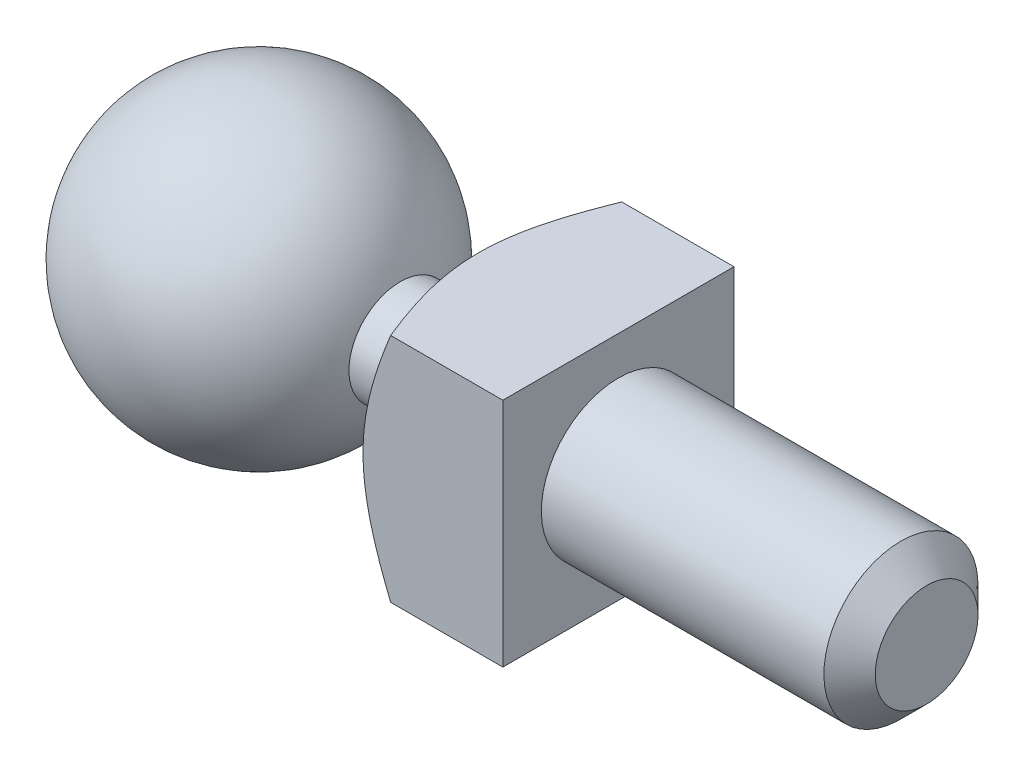
ISO-10303-21;
HEADER;
FILE_DESCRIPTION(('STEP AP214'),'2;1');
FILE_NAME('part.step','',(''),(''),'','','');
FILE_SCHEMA(('AUTOMOTIVE_DESIGN { 1 0 10303 214 1 1 1 1 }'));
ENDSEC;
DATA;
#1=APPLICATION_CONTEXT('core data for automotive mechanical design processes');
#2=APPLICATION_PROTOCOL_DEFINITION('international standard','automotive_design',2000,#1);
#3=PRODUCT_CONTEXT('',#1,'mechanical');
#4=PRODUCT('Part','Part','',(#3));
#5=PRODUCT_RELATED_PRODUCT_CATEGORY('part','',(#4));
#6=PRODUCT_DEFINITION_FORMATION('','',#4);
#7=PRODUCT_DEFINITION_CONTEXT('part definition',#1,'design');
#8=PRODUCT_DEFINITION('design','',#6,#7);
#9=PRODUCT_DEFINITION_SHAPE('','',#8);
#10=(LENGTH_UNIT() NAMED_UNIT(*) SI_UNIT(.MILLI.,.METRE.));
#11=(NAMED_UNIT(*) PLANE_ANGLE_UNIT() SI_UNIT($,.RADIAN.));
#12=(NAMED_UNIT(*) SI_UNIT($,.STERADIAN.) SOLID_ANGLE_UNIT());
#13=UNCERTAINTY_MEASURE_WITH_UNIT(LENGTH_MEASURE(1.E-05),#10,'distance_accuracy_value','');
#14=(GEOMETRIC_REPRESENTATION_CONTEXT(3) GLOBAL_UNCERTAINTY_ASSIGNED_CONTEXT((#13)) GLOBAL_UNIT_ASSIGNED_CONTEXT((#10,
#11,#12)) REPRESENTATION_CONTEXT('',''));
#15=CARTESIAN_POINT('',(0.,0.,0.));
#16=DIRECTION('',(0.,0.,1.));
#17=DIRECTION('',(1.,0.,0.));
#18=AXIS2_PLACEMENT_3D('',#15,#16,#17);
#19=CARTESIAN_POINT('',(0.,0.,0.));
#20=DIRECTION('',(1.,0.,0.));
#21=DIRECTION('',(0.,1.,0.));
#22=AXIS2_PLACEMENT_3D('',#19,#20,#21);
#23=SPHERICAL_SURFACE('',#22,2.93);
#24=CARTESIAN_POINT('',(2.75406971589319,0.,0.));
#25=DIRECTION('',(1.,0.,0.));
#26=DIRECTION('',(0.,1.,0.));
#27=AXIS2_PLACEMENT_3D('',#24,#25,#26);
#28=CIRCLE('',#27,0.999999999999999);
#29=CARTESIAN_POINT('',(2.75406971589319,0.999999999999999,0.));
#30=VERTEX_POINT('',#29);
#31=EDGE_CURVE('E95',#30,#30,#28,.T.);
#32=ORIENTED_EDGE('',*,*,#31,.F.);
#33=EDGE_LOOP('',(#32));
#34=FACE_BOUND('',#33,.T.);
#35=ADVANCED_FACE('F34',(#34),#23,.T.);
#36=CARTESIAN_POINT('',(13.,1.5,0.));
#37=DIRECTION('',(1.,0.,0.));
#38=DIRECTION('',(0.,1.,0.));
#39=AXIS2_PLACEMENT_3D('',#36,#37,#38);
#40=PLANE('',#39);
#41=CARTESIAN_POINT('',(13.,0.,0.));
#42=DIRECTION('',(1.,0.,0.));
#43=DIRECTION('',(0.,1.,0.));
#44=AXIS2_PLACEMENT_3D('',#41,#42,#43);
#45=CIRCLE('',#44,0.999999999999999);
#46=CARTESIAN_POINT('',(13.,0.999999999999999,0.));
#47=VERTEX_POINT('',#46);
#48=EDGE_CURVE('E42',#47,#47,#45,.T.);
#49=ORIENTED_EDGE('',*,*,#48,.T.);
#50=EDGE_LOOP('',(#49));
#51=FACE_BOUND('',#50,.T.);
#52=ADVANCED_FACE('F139',(#51),#40,.T.);
#53=CARTESIAN_POINT('',(13.,0.,0.));
#54=DIRECTION('',(1.,0.,0.));
#55=DIRECTION('',(0.,1.,0.));
#56=AXIS2_PLACEMENT_3D('',#53,#54,#55);
#57=CYLINDRICAL_SURFACE('',#56,1.5);
#58=CARTESIAN_POINT('',(12.5,0.,0.));
#59=DIRECTION('',(1.,0.,0.));
#60=DIRECTION('',(0.,1.,0.));
#61=AXIS2_PLACEMENT_3D('',#58,#59,#60);
#62=CIRCLE('',#61,1.5);
#63=CARTESIAN_POINT('',(12.5,1.5,0.));
#64=VERTEX_POINT('',#63);
#65=EDGE_CURVE('E11',#64,#64,#62,.F.);
#66=ORIENTED_EDGE('',*,*,#65,.T.);
#67=EDGE_LOOP('',(#66));
#68=FACE_BOUND('',#67,.T.);
#69=CARTESIAN_POINT('',(7.,0.,0.));
#70=DIRECTION('',(1.,0.,0.));
#71=DIRECTION('',(0.,1.,0.));
#72=AXIS2_PLACEMENT_3D('',#69,#70,#71);
#73=CIRCLE('',#72,1.5);
#74=CARTESIAN_POINT('',(7.,1.5,0.));
#75=VERTEX_POINT('',#74);
#76=EDGE_CURVE('E105',#75,#75,#73,.T.);
#77=ORIENTED_EDGE('',*,*,#76,.T.);
#78=EDGE_LOOP('',(#77));
#79=FACE_BOUND('',#78,.T.);
#80=ADVANCED_FACE('F144',(#68,#79),#57,.T.);
#81=CARTESIAN_POINT('',(7.,3.5,0.));
#82=DIRECTION('',(1.,0.,0.));
#83=DIRECTION('',(0.,1.,0.));
#84=AXIS2_PLACEMENT_3D('',#81,#82,#83);
#85=PLANE('',#84);
#86=DIRECTION('',(0.,-1.,0.));
#87=VECTOR('',#86,1.);
#88=CARTESIAN_POINT('',(7.,2.25,-2.25));
#89=LINE('',#88,#87);
#90=CARTESIAN_POINT('',(7.,2.25,-2.25));
#91=VERTEX_POINT('',#90);
#92=CARTESIAN_POINT('',(7.,-2.25,-2.25));
#93=VERTEX_POINT('',#92);
#94=EDGE_CURVE('E49',#91,#93,#89,.T.);
#95=ORIENTED_EDGE('',*,*,#94,.F.);
#96=DIRECTION('',(0.,0.,-1.));
#97=VECTOR('',#96,1.);
#98=CARTESIAN_POINT('',(7.,2.25,2.6809513236909));
#99=LINE('',#98,#97);
#100=CARTESIAN_POINT('',(7.,2.25,2.25));
#101=VERTEX_POINT('',#100);
#102=EDGE_CURVE('E89',#101,#91,#99,.T.);
#103=ORIENTED_EDGE('',*,*,#102,.F.);
#104=DIRECTION('',(0.,1.,0.));
#105=VECTOR('',#104,1.);
#106=CARTESIAN_POINT('',(7.,2.25,2.25));
#107=LINE('',#106,#105);
#108=CARTESIAN_POINT('',(7.,-2.25,2.25));
#109=VERTEX_POINT('',#108);
#110=EDGE_CURVE('E226',#109,#101,#107,.T.);
#111=ORIENTED_EDGE('',*,*,#110,.F.);
#112=DIRECTION('',(0.,0.,1.));
#113=VECTOR('',#112,1.);
#114=CARTESIAN_POINT('',(7.,-2.25,2.6809513236909));
#115=LINE('',#114,#113);
#116=EDGE_CURVE('E90',#93,#109,#115,.T.);
#117=ORIENTED_EDGE('',*,*,#116,.F.);
#118=EDGE_LOOP('',(#95,#103,#111,#117));
#119=FACE_BOUND('',#118,.T.);
#120=ORIENTED_EDGE('',*,*,#76,.F.);
#121=EDGE_LOOP('',(#120));
#122=FACE_BOUND('',#121,.T.);
#123=ADVANCED_FACE('F86',(#119,#122),#85,.T.);
#124=CARTESIAN_POINT('',(5.,0.,0.));
#125=DIRECTION('',(1.,0.,0.));
#126=DIRECTION('',(0.,1.,0.));
#127=AXIS2_PLACEMENT_3D('',#124,#125,#126);
#128=CONICAL_SURFACE('',#127,3.5,1.04719755119659);
#129=CARTESIAN_POINT('',(5.86034383960185,-4.45412048133046,-2.25));
#130=CARTESIAN_POINT('',(5.80409796865008,-4.34495840750382,-2.25));
#131=CARTESIAN_POINT('',(5.74817027483859,-4.23563076856428,-2.25));
#132=CARTESIAN_POINT('',(5.63712120538929,-4.01655867667886,-2.25));
#133=CARTESIAN_POINT('',(5.58199987885308,-3.906814198859,-2.25));
#134=CARTESIAN_POINT('',(5.47261288973695,-3.68657929952362,-2.25));
#135=CARTESIAN_POINT('',(5.41834952406275,-3.57608773491769,-2.25));
#136=CARTESIAN_POINT('',(5.31105407722902,-3.35451008879523,-2.25));
#137=CARTESIAN_POINT('',(5.2580219710597,-3.24342401941098,-2.25));
#138=CARTESIAN_POINT('',(5.15059383123246,-3.01431685986266,-2.25));
#139=CARTESIAN_POINT('',(5.09628634237491,-2.89625411328464,-2.25));
#140=CARTESIAN_POINT('',(4.98990333398757,-2.65912837226199,-2.25));
#141=CARTESIAN_POINT('',(4.93782773380177,-2.5400654141493,-2.25));
#142=CARTESIAN_POINT('',(4.83664749236006,-2.3007918583816,-2.25));
#143=CARTESIAN_POINT('',(4.78754042416504,-2.18058229385271,-2.25));
#144=CARTESIAN_POINT('',(4.69322647174154,-1.93865008704879,-2.25));
#145=CARTESIAN_POINT('',(4.64801908324752,-1.81692764273935,-2.25));
#146=CARTESIAN_POINT('',(4.56330589825001,-1.57300940057008,-2.25));
#147=CARTESIAN_POINT('',(4.52374189032616,-1.45083418979248,-2.25));
#148=CARTESIAN_POINT('',(4.46953383362664,-1.26606680452056,-2.25));
#149=CARTESIAN_POINT('',(4.45232103779299,-1.20422789992981,-2.25));
#150=CARTESIAN_POINT('',(4.41985945750954,-1.08001397293359,-2.25));
#151=CARTESIAN_POINT('',(4.40461137330032,-1.01763876778854,-2.25));
#152=CARTESIAN_POINT('',(4.36278027165919,-0.832189634968537,-2.25));
#153=CARTESIAN_POINT('',(4.33938036230688,-0.708369462746123,-2.25));
#154=CARTESIAN_POINT('',(4.30326654869105,-0.459174579321724,-2.25));
#155=CARTESIAN_POINT('',(4.29054816450314,-0.333800542235146,-2.25));
#156=CARTESIAN_POINT('',(4.27980792429339,-0.132050664820355,-2.25));
#157=CARTESIAN_POINT('',(4.27796683756936,-0.0558657713500594,-2.25));
#158=CARTESIAN_POINT('',(4.27876329379624,0.0964781067003903,-2.25));
#159=CARTESIAN_POINT('',(4.28140044935276,0.172637092951649,-2.25));
#160=CARTESIAN_POINT('',(4.29104245575081,0.324693699795921,-2.25));
#161=CARTESIAN_POINT('',(4.29804847530763,0.400591244986225,-2.25));
#162=CARTESIAN_POINT('',(4.31613734661439,0.551897537565175,-2.25));
#163=CARTESIAN_POINT('',(4.32722043926637,0.627306255802519,-2.25));
#164=CARTESIAN_POINT('',(4.35341290101767,0.779551222005937,-2.25));
#165=CARTESIAN_POINT('',(4.36862463512182,0.856369680093358,-2.25));
#166=CARTESIAN_POINT('',(4.40242819238122,1.00925307448264,-2.25));
#167=CARTESIAN_POINT('',(4.42102007469835,1.085317997571,-2.25));
#168=CARTESIAN_POINT('',(4.46109976802804,1.23671019624537,-2.25));
#169=CARTESIAN_POINT('',(4.48258881962152,1.31203714092174,-2.25));
#170=CARTESIAN_POINT('',(4.52800561382837,1.46194198292063,-2.25));
#171=CARTESIAN_POINT('',(4.55193321972537,1.53651992197855,-2.25));
#172=CARTESIAN_POINT('',(4.62332958263679,1.74897906332623,-2.25));
#173=CARTESIAN_POINT('',(4.67331206401782,1.88601489043221,-2.25));
#174=CARTESIAN_POINT('',(4.77833582949507,2.15814610617328,-2.25));
#175=CARTESIAN_POINT('',(4.83337858049892,2.29324091892659,-2.25));
#176=CARTESIAN_POINT('',(4.9471832077542,2.56200011880604,-2.25));
#177=CARTESIAN_POINT('',(5.00594862854344,2.69566299656587,-2.25));
#178=CARTESIAN_POINT('',(5.12617768507156,2.96174497223753,-2.25));
#179=CARTESIAN_POINT('',(5.18764102615396,3.09416420406739,-2.25));
#180=CARTESIAN_POINT('',(5.31280819059338,3.35847842415153,-2.25));
#181=CARTESIAN_POINT('',(5.37651881573421,3.49037018095607,-2.25));
#182=CARTESIAN_POINT('',(5.50551004492557,3.75338491830392,-2.25));
#183=CARTESIAN_POINT('',(5.57079068134851,3.88450788292586,-2.25));
#184=CARTESIAN_POINT('',(5.76837107296348,4.27681681420728,-2.25));
#185=CARTESIAN_POINT('',(5.90248031635392,4.53709053334557,-2.25));
#186=CARTESIAN_POINT('',(6.15547959892446,5.02108573113561,-2.25));
#187=CARTESIAN_POINT('',(6.27398663745045,5.24500878852145,-2.25));
#188=CARTESIAN_POINT('',(6.51265366330582,5.69201679746049,-2.25));
#189=CARTESIAN_POINT('',(6.63281390524972,5.91510161302288,-2.25));
#190=CARTESIAN_POINT('',(6.87350062557749,6.35911256479582,-2.25));
#191=CARTESIAN_POINT('',(6.99401906454412,6.58004306773227,-2.25));
#192=CARTESIAN_POINT('',(7.23593493244803,7.02137104308705,-2.25));
#193=CARTESIAN_POINT('',(7.3573321999493,7.2417686039548,-2.25));
#194=CARTESIAN_POINT('',(7.47904462885251,7.46199072468933,-2.25));
#195=B_SPLINE_CURVE_WITH_KNOTS('',3,(#129,#130,#131,#132,#133,#134,#135,#136,#137,#138,#139,
#140,#141,#142,#143,#144,#145,#146,#147,#148,#149,#150,#151,#152,#153,#154,#155,#156,#157,#158,
#159,#160,#161,#162,#163,#164,#165,#166,#167,#168,#169,#170,#171,#172,#173,#174,#175,#176,#177,
#178,#179,#180,#181,#182,#183,#184,#185,#186,#187,#188,#189,#190,#191,#192,#193,#194),
.UNSPECIFIED.,.F.,.F.,(4,2,2,2,2,2,2,2,2,2,2,2,2,2,2,2,2,2,2,2,2,2,2,2,2,2,2,2,2,2,2,2,4),(0.,
0.368403050374347,0.73682844107798,1.10611357428642,1.47539119986834,1.86523628739655,
2.25506727480336,2.64457511899298,3.03403252038826,3.41912597175193,3.61166663532637,
3.80427573338545,4.18191842056213,4.55940264190891,4.78790325879115,5.01638411002808,
5.24492610843865,5.47348161288175,5.7083239985989,5.9431704950985,6.17811787522828,
6.41305209038466,6.85049275236988,7.28806062510517,7.72605157917063,8.16399481599487,
8.60340179648496,9.04281784498672,9.92115834686142,10.6811974198966,11.4413548890038,
12.1963460239652,12.9512018228935),.UNSPECIFIED.);
#196=CARTESIAN_POINT('',(4.81639136492369,-2.25,-2.25));
#197=VERTEX_POINT('',#196);
#198=CARTESIAN_POINT('',(4.81639136492369,2.25,-2.25));
#199=VERTEX_POINT('',#198);
#200=EDGE_CURVE('E78',#197,#199,#195,.T.);
#201=ORIENTED_EDGE('',*,*,#200,.F.);
#202=CARTESIAN_POINT('',(6.28876082837321,-2.25,-5.27215402402813));
#203=CARTESIAN_POINT('',(6.22450474204957,-2.25,-5.15113453155913));
#204=CARTESIAN_POINT('',(6.16050373501307,-2.25,-5.02997867433084));
#205=CARTESIAN_POINT('',(6.03314503107468,-2.25,-4.78732443626679));
#206=CARTESIAN_POINT('',(5.96978735514456,-2.25,-4.66582604442874));
#207=CARTESIAN_POINT('',(5.84377624425233,-2.25,-4.42227710922074));
#208=CARTESIAN_POINT('',(5.78112375723229,-2.25,-4.30022607471742));
#209=CARTESIAN_POINT('',(5.65679032468332,-2.25,-4.05563140229241));
#210=CARTESIAN_POINT('',(5.59510936748794,-2.25,-3.93308777030822));
#211=CARTESIAN_POINT('',(5.46906463583891,-2.25,-3.67955064949904));
#212=CARTESIAN_POINT('',(5.40478101934955,-2.25,-3.54851721698607));
#213=CARTESIAN_POINT('',(5.27799678328084,-2.25,-3.28559124026794));
#214=CARTESIAN_POINT('',(5.21549613038265,-2.25,-3.15369871217364));
#215=CARTESIAN_POINT('',(5.09286818644937,-2.25,-2.88887548639274));
#216=CARTESIAN_POINT('',(5.03273993051372,-2.25,-2.75594523767649));
#217=CARTESIAN_POINT('',(4.91564401516198,-2.25,-2.48870630956857));
#218=CARTESIAN_POINT('',(4.85867610119135,-2.25,-2.35439774223132));
#219=CARTESIAN_POINT('',(4.74166814672203,-2.25,-2.06580740134562));
#220=CARTESIAN_POINT('',(4.68224714117716,-2.25,-1.91127111314026));
#221=CARTESIAN_POINT('',(4.57143700822848,-2.25,-1.59925085059149));
#222=CARTESIAN_POINT('',(4.52005013258039,-2.25,-1.44176606366037));
#223=CARTESIAN_POINT('',(4.43009705607375,-2.25,-1.12708767695283));
#224=CARTESIAN_POINT('',(4.39125486157125,-2.25,-0.969976331192509));
#225=CARTESIAN_POINT('',(4.34466441846132,-2.25,-0.732069679473725));
#226=CARTESIAN_POINT('',(4.33108177221732,-2.25,-0.652415306514375));
#227=CARTESIAN_POINT('',(4.30831193543774,-2.25,-0.492486113587141));
#228=CARTESIAN_POINT('',(4.29912430983061,-2.25,-0.412211355832105));
#229=CARTESIAN_POINT('',(4.280990941474,-2.25,-0.196620580672468));
#230=CARTESIAN_POINT('',(4.27643540584421,-2.25,-0.0608995022600645));
#231=CARTESIAN_POINT('',(4.28161896226905,-2.25,0.210225534625882));
#232=CARTESIAN_POINT('',(4.29135680155205,-2.25,0.345629519849896));
#233=CARTESIAN_POINT('',(4.32416809557623,-2.25,0.618003678315841));
#234=CARTESIAN_POINT('',(4.34755031755061,-2.25,0.754935597246552));
#235=CARTESIAN_POINT('',(4.39081063922233,-2.25,0.958545863431208));
#236=CARTESIAN_POINT('',(4.40660181742953,-2.25,1.02614005815985));
#237=CARTESIAN_POINT('',(4.44056642491053,-2.25,1.16072498339881));
#238=CARTESIAN_POINT('',(4.45873970517105,-2.25,1.22771575137681));
#239=CARTESIAN_POINT('',(4.51227524625755,-2.25,1.41367878982504));
#240=CARTESIAN_POINT('',(4.54989467283036,-2.25,1.53200017389067));
#241=CARTESIAN_POINT('',(4.63009916293539,-2.25,1.76695990204816));
#242=CARTESIAN_POINT('',(4.6726857819968,-2.25,1.88359770598938));
#243=CARTESIAN_POINT('',(4.76164511478409,-2.25,2.11555193189705));
#244=CARTESIAN_POINT('',(4.80802178680806,-2.25,2.23086682516245));
#245=CARTESIAN_POINT('',(4.90362228211462,-2.25,2.46031508375231));
#246=CARTESIAN_POINT('',(4.95284637042485,-2.25,2.57444833792451));
#247=CARTESIAN_POINT('',(5.05368971229989,-2.25,2.80222533988991));
#248=CARTESIAN_POINT('',(5.10531821351763,-2.25,2.91586497720077));
#249=CARTESIAN_POINT('',(5.21029195408943,-2.25,3.14235003815041));
#250=CARTESIAN_POINT('',(5.26363724814803,-2.25,3.25519543634135));
#251=CARTESIAN_POINT('',(5.42569096043756,-2.25,3.5927871389017));
#252=CARTESIAN_POINT('',(5.53640812021851,-2.25,3.81656880263123));
#253=CARTESIAN_POINT('',(5.69915353805128,-2.25,4.13920611884436));
#254=CARTESIAN_POINT('',(5.74980586128649,-2.25,4.23876409117146));
#255=CARTESIAN_POINT('',(5.85169717831487,-2.25,4.43757274064262));
#256=CARTESIAN_POINT('',(5.90293613764671,-2.25,4.53682343540666));
#257=CARTESIAN_POINT('',(6.05741162087119,-2.25,4.83423222342052));
#258=CARTESIAN_POINT('',(6.16138629449011,-2.25,5.03200666350579));
#259=CARTESIAN_POINT('',(6.36973551405003,-2.25,5.42486548920937));
#260=CARTESIAN_POINT('',(6.47409618091824,-2.25,5.6199572554507));
#261=CARTESIAN_POINT('',(6.6838675780985,-2.25,6.00952067282206));
#262=CARTESIAN_POINT('',(6.78927807332976,-2.25,6.20399245045497));
#263=CARTESIAN_POINT('',(6.89506300869482,-2.25,6.39825830386648));
#264=B_SPLINE_CURVE_WITH_KNOTS('',3,(#202,#203,#204,#205,#206,#207,#208,#209,#210,#211,#212,
#213,#214,#215,#216,#217,#218,#219,#220,#221,#222,#223,#224,#225,#226,#227,#228,#229,#230,#231,
#232,#233,#234,#235,#236,#237,#238,#239,#240,#241,#242,#243,#244,#245,#246,#247,#248,#249,#250,
#251,#252,#253,#254,#255,#256,#257,#258,#259,#260,#261,#262,#263),.UNSPECIFIED.,.F.,.F.,(4,2,2,
2,2,2,2,2,2,2,2,2,2,2,2,2,2,2,2,2,2,2,2,2,2,2,2,2,2,2,4),(0.,0.411061812363979,
0.822136982069995,1.23371101365729,1.6452800991565,2.08312735823082,2.52096642973616,
2.95862554815609,3.39624936332024,3.8927932699587,4.38947609630069,4.87433934752985,
5.11664431483083,5.35892529093082,5.76552629074053,6.17209165531461,6.58823523734191,
6.79644468337781,7.00464111100458,7.37695377553779,7.74938334838089,8.12220697991334,
8.49506536858903,8.86950035764448,9.24394728967425,9.99290744492505,10.3280147845321,
10.6631025385927,11.3334137741989,11.9971629479937,12.6607666930849),.UNSPECIFIED.);
#265=CARTESIAN_POINT('',(4.81639136492369,-2.25,2.25));
#266=VERTEX_POINT('',#265);
#267=EDGE_CURVE('E115',#266,#197,#264,.F.);
#268=ORIENTED_EDGE('',*,*,#267,.F.);
#269=CARTESIAN_POINT('',(5.86034383960185,-4.45412048133046,2.25));
#270=CARTESIAN_POINT('',(5.80409796865008,-4.34495840750382,2.25));
#271=CARTESIAN_POINT('',(5.74817027483859,-4.23563076856428,2.25));
#272=CARTESIAN_POINT('',(5.63712120538929,-4.01655867667887,2.25));
#273=CARTESIAN_POINT('',(5.58199987885308,-3.906814198859,2.25));
#274=CARTESIAN_POINT('',(5.47261288973694,-3.68657929952362,2.25));
#275=CARTESIAN_POINT('',(5.41834952406275,-3.57608773491769,2.25));
#276=CARTESIAN_POINT('',(5.31105407722902,-3.35451008879523,2.25));
#277=CARTESIAN_POINT('',(5.2580219710597,-3.24342401941098,2.25));
#278=CARTESIAN_POINT('',(5.15059383123246,-3.01431685986266,2.25));
#279=CARTESIAN_POINT('',(5.09628634237491,-2.89625411328464,2.25));
#280=CARTESIAN_POINT('',(4.98990333398756,-2.65912837226199,2.25));
#281=CARTESIAN_POINT('',(4.93782773380177,-2.5400654141493,2.25));
#282=CARTESIAN_POINT('',(4.83664749236006,-2.3007918583816,2.25));
#283=CARTESIAN_POINT('',(4.78754042416504,-2.18058229385271,2.25));
#284=CARTESIAN_POINT('',(4.69322647174154,-1.93865008704879,2.25));
#285=CARTESIAN_POINT('',(4.64801908324752,-1.81692764273935,2.25));
#286=CARTESIAN_POINT('',(4.56330589825,-1.57300940057008,2.25));
#287=CARTESIAN_POINT('',(4.52374189032616,-1.45083418979248,2.25));
#288=CARTESIAN_POINT('',(4.46953383362665,-1.26606680452056,2.25));
#289=CARTESIAN_POINT('',(4.45232103779299,-1.20422789992981,2.25));
#290=CARTESIAN_POINT('',(4.41985945750954,-1.08001397293359,2.25));
#291=CARTESIAN_POINT('',(4.40461137330032,-1.01763876778854,2.25));
#292=CARTESIAN_POINT('',(4.36278027165919,-0.832189634968537,2.25));
#293=CARTESIAN_POINT('',(4.33938036230688,-0.708369462746124,2.25));
#294=CARTESIAN_POINT('',(4.30326654869105,-0.459174579321724,2.25));
#295=CARTESIAN_POINT('',(4.29054816450314,-0.333800542235147,2.25));
#296=CARTESIAN_POINT('',(4.27980792429339,-0.132050664820355,2.25));
#297=CARTESIAN_POINT('',(4.27796683756936,-0.0558657713500601,2.25));
#298=CARTESIAN_POINT('',(4.27876329379624,0.0964781067003896,2.25));
#299=CARTESIAN_POINT('',(4.28140044935276,0.172637092951648,2.25));
#300=CARTESIAN_POINT('',(4.29104245575081,0.32469369979592,2.25));
#301=CARTESIAN_POINT('',(4.29804847530763,0.400591244986224,2.25));
#302=CARTESIAN_POINT('',(4.31613734661439,0.551897537565174,2.25));
#303=CARTESIAN_POINT('',(4.32722043926637,0.627306255802518,2.25));
#304=CARTESIAN_POINT('',(4.35341290101767,0.779551222005937,2.25));
#305=CARTESIAN_POINT('',(4.36862463512182,0.856369680093357,2.25));
#306=CARTESIAN_POINT('',(4.40242819238122,1.00925307448264,2.25));
#307=CARTESIAN_POINT('',(4.42102007469835,1.085317997571,2.25));
#308=CARTESIAN_POINT('',(4.46109976802804,1.23671019624537,2.25));
#309=CARTESIAN_POINT('',(4.48258881962152,1.31203714092174,2.25));
#310=CARTESIAN_POINT('',(4.52800561382837,1.46194198292063,2.25));
#311=CARTESIAN_POINT('',(4.55193321972537,1.53651992197855,2.25));
#312=CARTESIAN_POINT('',(4.62332958263679,1.74897906332623,2.25));
#313=CARTESIAN_POINT('',(4.67331206401782,1.88601489043221,2.25));
#314=CARTESIAN_POINT('',(4.77833582949507,2.15814610617328,2.25));
#315=CARTESIAN_POINT('',(4.83337858049892,2.29324091892659,2.25));
#316=CARTESIAN_POINT('',(4.9471832077542,2.56200011880604,2.25));
#317=CARTESIAN_POINT('',(5.00594862854344,2.69566299656587,2.25));
#318=CARTESIAN_POINT('',(5.12617768507156,2.96174497223753,2.25));
#319=CARTESIAN_POINT('',(5.18764102615396,3.09416420406739,2.25));
#320=CARTESIAN_POINT('',(5.31280819059338,3.35847842415153,2.25));
#321=CARTESIAN_POINT('',(5.37651881573421,3.49037018095607,2.25));
#322=CARTESIAN_POINT('',(5.50551004492557,3.75338491830391,2.25));
#323=CARTESIAN_POINT('',(5.5707906813485,3.88450788292586,2.25));
#324=CARTESIAN_POINT('',(5.76837107296348,4.27681681420727,2.25));
#325=CARTESIAN_POINT('',(5.90248031635391,4.53709053334557,2.25));
#326=CARTESIAN_POINT('',(6.15547959892445,5.0210857311356,2.25));
#327=CARTESIAN_POINT('',(6.27398663745044,5.24500878852145,2.25));
#328=CARTESIAN_POINT('',(6.51265366330581,5.69201679746048,2.25));
#329=CARTESIAN_POINT('',(6.63281390524972,5.91510161302287,2.25));
#330=CARTESIAN_POINT('',(6.87350062557748,6.35911256479581,2.25));
#331=CARTESIAN_POINT('',(6.99401906454411,6.58004306773227,2.25));
#332=CARTESIAN_POINT('',(7.23593493244803,7.02137104308704,2.25));
#333=CARTESIAN_POINT('',(7.3573321999493,7.24176860395479,2.25));
#334=CARTESIAN_POINT('',(7.47904462885251,7.46199072468933,2.25));
#335=B_SPLINE_CURVE_WITH_KNOTS('',3,(#269,#270,#271,#272,#273,#274,#275,#276,#277,#278,#279,
#280,#281,#282,#283,#284,#285,#286,#287,#288,#289,#290,#291,#292,#293,#294,#295,#296,#297,#298,
#299,#300,#301,#302,#303,#304,#305,#306,#307,#308,#309,#310,#311,#312,#313,#314,#315,#316,#317,
#318,#319,#320,#321,#322,#323,#324,#325,#326,#327,#328,#329,#330,#331,#332,#333,#334),
.UNSPECIFIED.,.F.,.F.,(4,2,2,2,2,2,2,2,2,2,2,2,2,2,2,2,2,2,2,2,2,2,2,2,2,2,2,2,2,2,2,2,4),(0.,
0.368403050374346,0.736828441077979,1.10611357428642,1.47539119986834,1.86523628739655,
2.25506727480336,2.64457511899298,3.03403252038826,3.41912597175193,3.61166663532637,
3.80427573338545,4.18191842056213,4.55940264190891,4.78790325879115,5.01638411002808,
5.24492610843865,5.47348161288175,5.7083239985989,5.9431704950985,6.17811787522828,
6.41305209038466,6.85049275236988,7.28806062510517,7.72605157917063,8.16399481599487,
8.60340179648496,9.04281784498672,9.92115834686142,10.6811974198966,11.4413548890038,
12.1963460239652,12.9512018228935),.UNSPECIFIED.);
#336=CARTESIAN_POINT('',(4.81639136492369,2.25,2.25));
#337=VERTEX_POINT('',#336);
#338=EDGE_CURVE('E57',#337,#266,#335,.F.);
#339=ORIENTED_EDGE('',*,*,#338,.F.);
#340=CARTESIAN_POINT('',(6.28876082837321,2.25,-5.27215402402813));
#341=CARTESIAN_POINT('',(6.22450474204957,2.25,-5.15113453155913));
#342=CARTESIAN_POINT('',(6.16050373501307,2.25,-5.02997867433084));
#343=CARTESIAN_POINT('',(6.03314503107468,2.25,-4.78732443626679));
#344=CARTESIAN_POINT('',(5.96978735514456,2.25,-4.66582604442874));
#345=CARTESIAN_POINT('',(5.84377624425233,2.25,-4.42227710922075));
#346=CARTESIAN_POINT('',(5.78112375723229,2.25,-4.30022607471742));
#347=CARTESIAN_POINT('',(5.65679032468332,2.25,-4.05563140229241));
#348=CARTESIAN_POINT('',(5.59510936748794,2.25,-3.93308777030822));
#349=CARTESIAN_POINT('',(5.46906463583891,2.25,-3.67955064949904));
#350=CARTESIAN_POINT('',(5.40478101934955,2.25,-3.54851721698607));
#351=CARTESIAN_POINT('',(5.27799678328084,2.25,-3.28559124026794));
#352=CARTESIAN_POINT('',(5.21549613038265,2.25,-3.15369871217364));
#353=CARTESIAN_POINT('',(5.09286818644937,2.25,-2.88887548639275));
#354=CARTESIAN_POINT('',(5.03273993051372,2.25,-2.75594523767649));
#355=CARTESIAN_POINT('',(4.91564401516198,2.25,-2.48870630956857));
#356=CARTESIAN_POINT('',(4.85867610119135,2.25,-2.35439774223132));
#357=CARTESIAN_POINT('',(4.74166814672204,2.25,-2.06580740134562));
#358=CARTESIAN_POINT('',(4.68224714117717,2.25,-1.91127111314026));
#359=CARTESIAN_POINT('',(4.57143700822848,2.25,-1.59925085059149));
#360=CARTESIAN_POINT('',(4.52005013258039,2.25,-1.44176606366037));
#361=CARTESIAN_POINT('',(4.43009705607375,2.25,-1.12708767695283));
#362=CARTESIAN_POINT('',(4.39125486157125,2.25,-0.969976331192509));
#363=CARTESIAN_POINT('',(4.34466441846132,2.25,-0.732069679473725));
#364=CARTESIAN_POINT('',(4.33108177221732,2.25,-0.652415306514375));
#365=CARTESIAN_POINT('',(4.30831193543774,2.25,-0.492486113587141));
#366=CARTESIAN_POINT('',(4.29912430983061,2.25,-0.412211355832105));
#367=CARTESIAN_POINT('',(4.280990941474,2.25,-0.196620580672468));
#368=CARTESIAN_POINT('',(4.27643540584421,2.25,-0.0608995022600646));
#369=CARTESIAN_POINT('',(4.28161896226905,2.25,0.210225534625881));
#370=CARTESIAN_POINT('',(4.29135680155205,2.25,0.345629519849895));
#371=CARTESIAN_POINT('',(4.32416809557623,2.25,0.61800367831584));
#372=CARTESIAN_POINT('',(4.34755031755061,2.25,0.754935597246551));
#373=CARTESIAN_POINT('',(4.39081063922233,2.25,0.958545863431207));
#374=CARTESIAN_POINT('',(4.40660181742953,2.25,1.02614005815985));
#375=CARTESIAN_POINT('',(4.44056642491053,2.25,1.16072498339881));
#376=CARTESIAN_POINT('',(4.45873970517105,2.25,1.22771575137681));
#377=CARTESIAN_POINT('',(4.51227524625755,2.25,1.41367878982504));
#378=CARTESIAN_POINT('',(4.54989467283036,2.25,1.53200017389067));
#379=CARTESIAN_POINT('',(4.63009916293539,2.25,1.76695990204816));
#380=CARTESIAN_POINT('',(4.6726857819968,2.25,1.88359770598938));
#381=CARTESIAN_POINT('',(4.76164511478409,2.25,2.11555193189705));
#382=CARTESIAN_POINT('',(4.80802178680806,2.25,2.23086682516245));
#383=CARTESIAN_POINT('',(4.90362228211462,2.25,2.46031508375231));
#384=CARTESIAN_POINT('',(4.95284637042485,2.25,2.57444833792451));
#385=CARTESIAN_POINT('',(5.05368971229989,2.25,2.80222533988991));
#386=CARTESIAN_POINT('',(5.10531821351763,2.25,2.91586497720077));
#387=CARTESIAN_POINT('',(5.21029195408943,2.25,3.14235003815041));
#388=CARTESIAN_POINT('',(5.26363724814803,2.25,3.25519543634135));
#389=CARTESIAN_POINT('',(5.42569096043756,2.25,3.59278713890171));
#390=CARTESIAN_POINT('',(5.53640812021851,2.25,3.81656880263123));
#391=CARTESIAN_POINT('',(5.69915353805128,2.25,4.13920611884436));
#392=CARTESIAN_POINT('',(5.74980586128649,2.25,4.23876409117145));
#393=CARTESIAN_POINT('',(5.85169717831487,2.25,4.43757274064262));
#394=CARTESIAN_POINT('',(5.90293613764672,2.25,4.53682343540666));
#395=CARTESIAN_POINT('',(6.05741162087119,2.25,4.83423222342052));
#396=CARTESIAN_POINT('',(6.16138629449011,2.25,5.03200666350579));
#397=CARTESIAN_POINT('',(6.36973551405003,2.25,5.42486548920937));
#398=CARTESIAN_POINT('',(6.47409618091824,2.25,5.6199572554507));
#399=CARTESIAN_POINT('',(6.6838675780985,2.25,6.00952067282206));
#400=CARTESIAN_POINT('',(6.78927807332976,2.25,6.20399245045497));
#401=CARTESIAN_POINT('',(6.89506300869482,2.25,6.39825830386648));
#402=B_SPLINE_CURVE_WITH_KNOTS('',3,(#340,#341,#342,#343,#344,#345,#346,#347,#348,#349,#350,
#351,#352,#353,#354,#355,#356,#357,#358,#359,#360,#361,#362,#363,#364,#365,#366,#367,#368,#369,
#370,#371,#372,#373,#374,#375,#376,#377,#378,#379,#380,#381,#382,#383,#384,#385,#386,#387,#388,
#389,#390,#391,#392,#393,#394,#395,#396,#397,#398,#399,#400,#401),.UNSPECIFIED.,.F.,.F.,(4,2,2,
2,2,2,2,2,2,2,2,2,2,2,2,2,2,2,2,2,2,2,2,2,2,2,2,2,2,2,4),(0.,0.411061812363977,
0.822136982069994,1.23371101365729,1.6452800991565,2.08312735823082,2.52096642973616,
2.95862554815609,3.39624936332024,3.8927932699587,4.38947609630069,4.87433934752985,
5.11664431483083,5.35892529093082,5.76552629074053,6.17209165531461,6.58823523734191,
6.79644468337781,7.00464111100458,7.37695377553779,7.7493833483809,8.12220697991334,
8.49506536858903,8.86950035764448,9.24394728967425,9.99290744492505,10.328014784532,
10.6631025385927,11.3334137741989,11.9971629479937,12.6607666930849),.UNSPECIFIED.);
#403=EDGE_CURVE('E108',#199,#337,#402,.T.);
#404=ORIENTED_EDGE('',*,*,#403,.F.);
#405=EDGE_LOOP('',(#201,#268,#339,#404));
#406=FACE_BOUND('',#405,.T.);
#407=CARTESIAN_POINT('',(3.55662432702592,0.,0.));
#408=DIRECTION('',(1.,0.,0.));
#409=DIRECTION('',(0.,1.,0.));
#410=AXIS2_PLACEMENT_3D('',#407,#408,#409);
#411=CIRCLE('',#410,0.999999999999999);
#412=CARTESIAN_POINT('',(3.55662432702592,0.999999999999999,0.));
#413=VERTEX_POINT('',#412);
#414=EDGE_CURVE('E98',#413,#413,#411,.T.);
#415=ORIENTED_EDGE('',*,*,#414,.T.);
#416=EDGE_LOOP('',(#415));
#417=FACE_BOUND('',#416,.T.);
#418=ADVANCED_FACE('F121',(#406,#417),#128,.T.);
#419=CARTESIAN_POINT('',(13.,0.,0.));
#420=DIRECTION('',(1.,0.,0.));
#421=DIRECTION('',(0.,1.,0.));
#422=AXIS2_PLACEMENT_3D('',#419,#420,#421);
#423=CYLINDRICAL_SURFACE('',#422,0.999999999999999);
#424=ORIENTED_EDGE('',*,*,#31,.T.);
#425=EDGE_LOOP('',(#424));
#426=FACE_BOUND('',#425,.T.);
#427=ORIENTED_EDGE('',*,*,#414,.F.);
#428=EDGE_LOOP('',(#427));
#429=FACE_BOUND('',#428,.T.);
#430=ADVANCED_FACE('F128',(#426,#429),#423,.T.);
#431=CARTESIAN_POINT('',(4.,2.25,2.6809513236909));
#432=DIRECTION('',(0.,-1.,0.));
#433=DIRECTION('',(1.,0.,0.));
#434=AXIS2_PLACEMENT_3D('',#431,#432,#433);
#435=PLANE('',#434);
#436=ORIENTED_EDGE('',*,*,#102,.T.);
#437=DIRECTION('',(1.,0.,0.));
#438=VECTOR('',#437,1.);
#439=CARTESIAN_POINT('',(4.25,2.25,-2.25));
#440=LINE('',#439,#438);
#441=EDGE_CURVE('E75',#199,#91,#440,.T.);
#442=ORIENTED_EDGE('',*,*,#441,.F.);
#443=ORIENTED_EDGE('',*,*,#403,.T.);
#444=DIRECTION('',(1.,0.,0.));
#445=VECTOR('',#444,1.);
#446=CARTESIAN_POINT('',(4.25,2.25,2.25));
#447=LINE('',#446,#445);
#448=EDGE_CURVE('E94',#337,#101,#447,.T.);
#449=ORIENTED_EDGE('',*,*,#448,.T.);
#450=EDGE_LOOP('',(#436,#442,#443,#449));
#451=FACE_BOUND('',#450,.T.);
#452=ADVANCED_FACE('F93',(#451),#435,.F.);
#453=CARTESIAN_POINT('',(4.,-2.25,2.6809513236909));
#454=DIRECTION('',(0.,1.,0.));
#455=DIRECTION('',(-1.,0.,0.));
#456=AXIS2_PLACEMENT_3D('',#453,#454,#455);
#457=PLANE('',#456);
#458=ORIENTED_EDGE('',*,*,#267,.T.);
#459=DIRECTION('',(1.,0.,0.));
#460=VECTOR('',#459,1.);
#461=CARTESIAN_POINT('',(4.,-2.25,-2.25));
#462=LINE('',#461,#460);
#463=EDGE_CURVE('E220',#197,#93,#462,.T.);
#464=ORIENTED_EDGE('',*,*,#463,.T.);
#465=ORIENTED_EDGE('',*,*,#116,.T.);
#466=DIRECTION('',(-1.,0.,0.));
#467=VECTOR('',#466,1.);
#468=CARTESIAN_POINT('',(4.,-2.25,2.25));
#469=LINE('',#468,#467);
#470=EDGE_CURVE('E221',#109,#266,#469,.T.);
#471=ORIENTED_EDGE('',*,*,#470,.T.);
#472=EDGE_LOOP('',(#458,#464,#465,#471));
#473=FACE_BOUND('',#472,.T.);
#474=ADVANCED_FACE('F127',(#473),#457,.F.);
#475=CARTESIAN_POINT('',(4.25,2.25,2.25));
#476=DIRECTION('',(0.,0.,-1.));
#477=DIRECTION('',(0.,1.,0.));
#478=AXIS2_PLACEMENT_3D('',#475,#476,#477);
#479=PLANE('',#478);
#480=ORIENTED_EDGE('',*,*,#338,.T.);
#481=ORIENTED_EDGE('',*,*,#470,.F.);
#482=ORIENTED_EDGE('',*,*,#110,.T.);
#483=ORIENTED_EDGE('',*,*,#448,.F.);
#484=EDGE_LOOP('',(#480,#481,#482,#483));
#485=FACE_BOUND('',#484,.T.);
#486=ADVANCED_FACE('F176',(#485),#479,.F.);
#487=CARTESIAN_POINT('',(4.25,2.25,-2.25));
#488=DIRECTION('',(0.,0.,1.));
#489=DIRECTION('',(0.,-1.,0.));
#490=AXIS2_PLACEMENT_3D('',#487,#488,#489);
#491=PLANE('',#490);
#492=ORIENTED_EDGE('',*,*,#200,.T.);
#493=ORIENTED_EDGE('',*,*,#441,.T.);
#494=ORIENTED_EDGE('',*,*,#94,.T.);
#495=ORIENTED_EDGE('',*,*,#463,.F.);
#496=EDGE_LOOP('',(#492,#493,#494,#495));
#497=FACE_BOUND('',#496,.T.);
#498=ADVANCED_FACE('F76',(#497),#491,.F.);
#499=CARTESIAN_POINT('',(13.,0.,0.));
#500=DIRECTION('',(-1.,0.,0.));
#501=DIRECTION('',(0.,-1.,0.));
#502=AXIS2_PLACEMENT_3D('',#499,#500,#501);
#503=CONICAL_SURFACE('',#502,0.999999999999999,0.785398163397448);
#504=ORIENTED_EDGE('',*,*,#65,.F.);
#505=EDGE_LOOP('',(#504));
#506=FACE_BOUND('',#505,.T.);
#507=ORIENTED_EDGE('',*,*,#48,.F.);
#508=EDGE_LOOP('',(#507));
#509=FACE_BOUND('',#508,.T.);
#510=ADVANCED_FACE('F36',(#506,#509),#503,.T.);
#511=CLOSED_SHELL('',(#35,#52,#80,#123,#418,#430,#452,#474,#486,#498,#510));
#512=MANIFOLD_SOLID_BREP('B2',#511);
#513=ADVANCED_BREP_SHAPE_REPRESENTATION('',(#18,#512),#14);
#514=SHAPE_DEFINITION_REPRESENTATION(#9,#513);
ENDSEC;
END-ISO-10303-21;
